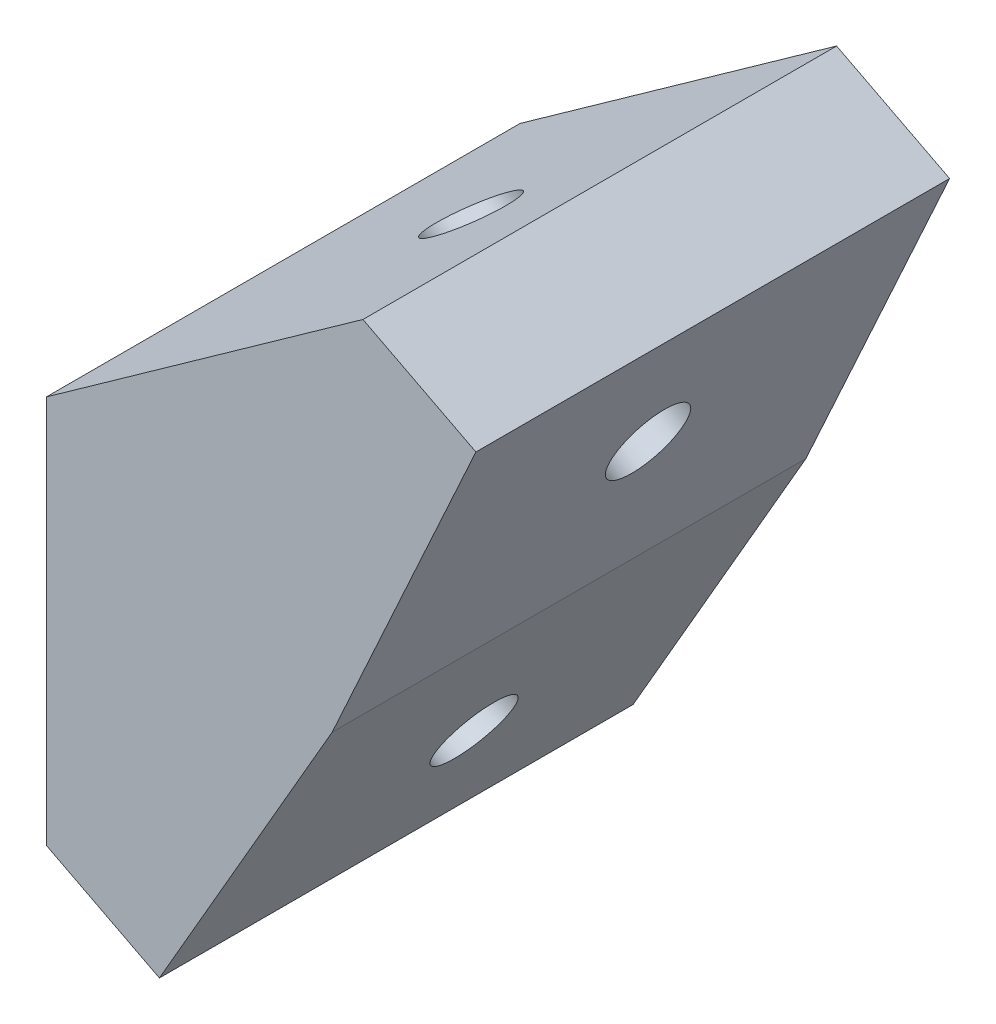
ISO-10303-21;
HEADER;
FILE_DESCRIPTION(('STEP AP214'),'2;1');
FILE_NAME('part.step','',(''),(''),'','','');
FILE_SCHEMA(('AUTOMOTIVE_DESIGN { 1 0 10303 214 1 1 1 1 }'));
ENDSEC;
DATA;
#1=APPLICATION_CONTEXT('core data for automotive mechanical design processes');
#2=APPLICATION_PROTOCOL_DEFINITION('international standard','automotive_design',2000,#1);
#3=PRODUCT_CONTEXT('',#1,'mechanical');
#4=PRODUCT('Part','Part','',(#3));
#5=PRODUCT_RELATED_PRODUCT_CATEGORY('part','',(#4));
#6=PRODUCT_DEFINITION_FORMATION('','',#4);
#7=PRODUCT_DEFINITION_CONTEXT('part definition',#1,'design');
#8=PRODUCT_DEFINITION('design','',#6,#7);
#9=PRODUCT_DEFINITION_SHAPE('','',#8);
#10=(LENGTH_UNIT() NAMED_UNIT(*) SI_UNIT(.MILLI.,.METRE.));
#11=(NAMED_UNIT(*) PLANE_ANGLE_UNIT() SI_UNIT($,.RADIAN.));
#12=(NAMED_UNIT(*) SI_UNIT($,.STERADIAN.) SOLID_ANGLE_UNIT());
#13=UNCERTAINTY_MEASURE_WITH_UNIT(LENGTH_MEASURE(1.E-05),#10,'distance_accuracy_value','');
#14=(GEOMETRIC_REPRESENTATION_CONTEXT(3) GLOBAL_UNCERTAINTY_ASSIGNED_CONTEXT((#13)) GLOBAL_UNIT_ASSIGNED_CONTEXT((#10,
#11,#12)) REPRESENTATION_CONTEXT('',''));
#15=CARTESIAN_POINT('',(0.,0.,0.));
#16=DIRECTION('',(0.,0.,1.));
#17=DIRECTION('',(1.,0.,0.));
#18=AXIS2_PLACEMENT_3D('',#15,#16,#17);
#19=CARTESIAN_POINT('',(5.52101325506801,15.6773344329994,7.5));
#20=DIRECTION('',(-0.866025403784439,0.5,0.));
#21=DIRECTION('',(-0.5,-0.866025403784439,0.));
#22=AXIS2_PLACEMENT_3D('',#19,#20,#21);
#23=PLANE('',#22);
#24=DIRECTION('',(0.5,0.866025403784439,0.));
#25=VECTOR('',#24,1.);
#26=CARTESIAN_POINT('',(5.52101325506801,15.6773344329994,-7.5));
#27=LINE('',#26,#25);
#28=CARTESIAN_POINT('',(0.0473877982673191,6.19673704021823,-7.5));
#29=VERTEX_POINT('',#28);
#30=CARTESIAN_POINT('',(5.52101325506801,15.6773344329994,-7.5));
#31=VERTEX_POINT('',#30);
#32=EDGE_CURVE('E143',#29,#31,#27,.T.);
#33=ORIENTED_EDGE('',*,*,#32,.T.);
#34=DIRECTION('',(0.,0.,-1.));
#35=VECTOR('',#34,1.);
#36=CARTESIAN_POINT('',(5.52101325506801,15.6773344329994,7.5));
#37=LINE('',#36,#35);
#38=CARTESIAN_POINT('',(5.52101325506801,15.6773344329994,7.5));
#39=VERTEX_POINT('',#38);
#40=EDGE_CURVE('E140',#39,#31,#37,.T.);
#41=ORIENTED_EDGE('',*,*,#40,.F.);
#42=DIRECTION('',(0.5,0.866025403784439,0.));
#43=VECTOR('',#42,1.);
#44=CARTESIAN_POINT('',(5.52101325506801,15.6773344329994,7.5));
#45=LINE('',#44,#43);
#46=CARTESIAN_POINT('',(0.0473877982673191,6.19673704021823,7.5));
#47=VERTEX_POINT('',#46);
#48=EDGE_CURVE('E85',#47,#39,#45,.T.);
#49=ORIENTED_EDGE('',*,*,#48,.F.);
#50=DIRECTION('',(0.,0.,-1.));
#51=VECTOR('',#50,1.);
#52=CARTESIAN_POINT('',(0.0473877982673191,6.19673704021823,7.5));
#53=LINE('',#52,#51);
#54=EDGE_CURVE('E52',#47,#29,#53,.T.);
#55=ORIENTED_EDGE('',*,*,#54,.T.);
#56=EDGE_LOOP('',(#33,#41,#49,#55));
#57=FACE_BOUND('',#56,.T.);
#58=CARTESIAN_POINT('',(3.1381275611136,11.5500553424414,0.));
#59=CARTESIAN_POINT('',(3.13812586989761,11.5500524131693,0.0692360372808874));
#60=CARTESIAN_POINT('',(3.13524078057893,11.545055291885,0.138544759383838));
#61=CARTESIAN_POINT('',(3.12377598581995,11.5251976848641,0.275212471246378));
#62=CARTESIAN_POINT('',(3.11519628037548,11.5103371991203,0.342571461004542));
#63=CARTESIAN_POINT('',(3.09258087567953,11.4711661691532,0.473531004420601));
#64=CARTESIAN_POINT('',(3.07854517748246,11.4468556267562,0.537131558804842));
#65=CARTESIAN_POINT('',(3.0454043837457,11.389454088201,0.658806862274307));
#66=CARTESIAN_POINT('',(3.02629928983129,11.3563630948578,0.716881613131123));
#67=CARTESIAN_POINT('',(2.98354679549131,11.2823136025107,0.825907059313257));
#68=CARTESIAN_POINT('',(2.95989939674911,11.2413551064224,0.87685775727871));
#69=CARTESIAN_POINT('',(2.90871448555333,11.1527002396504,0.970228867189444));
#70=CARTESIAN_POINT('',(2.88117697457791,11.1050038715269,1.01264928237607));
#71=CARTESIAN_POINT('',(2.82297137312598,11.0041888125271,1.08779007522114));
#72=CARTESIAN_POINT('',(2.79230328373808,10.9510701235362,1.12051045625263));
#73=CARTESIAN_POINT('',(2.72868239030743,10.8408755036914,1.17534864926352));
#74=CARTESIAN_POINT('',(2.69572958689845,10.7837995739352,1.19746646418398));
#75=CARTESIAN_POINT('',(2.62844814721414,10.6672647019956,1.23048951180264));
#76=CARTESIAN_POINT('',(2.59411951118186,10.6078057602331,1.24139474648159));
#77=CARTESIAN_POINT('',(2.5250332328754,10.4881448161005,1.25169185277393));
#78=CARTESIAN_POINT('',(2.49027559062548,10.4279428137723,1.25108372503852));
#79=CARTESIAN_POINT('',(2.42128996105827,10.3084561983698,1.23837088247362));
#80=CARTESIAN_POINT('',(2.3870619737408,10.2491715852951,1.22626616764806));
#81=CARTESIAN_POINT('',(2.32007970820101,10.1331548981741,1.19089401654128));
#82=CARTESIAN_POINT('',(2.28732542997694,10.0764228241248,1.16762658027333));
#83=CARTESIAN_POINT('',(2.22419398920809,9.96707596115812,1.1105707362929));
#84=CARTESIAN_POINT('',(2.19381682665879,9.91446117223296,1.07678232860045));
#85=CARTESIAN_POINT('',(2.13627745880945,9.81480006368251,0.999616474341237));
#86=CARTESIAN_POINT('',(2.10911525350165,9.76775374404379,0.956239027797604));
#87=CARTESIAN_POINT('',(2.05875496791351,9.68052717072145,0.861091506092004));
#88=CARTESIAN_POINT('',(2.03555688762264,9.64034691701961,0.809321430952323));
#89=CARTESIAN_POINT('',(1.99376468327898,9.56796069573607,0.698816540403905));
#90=CARTESIAN_POINT('',(1.97517055921417,9.53575472813358,0.64008172501333));
#91=CARTESIAN_POINT('',(1.94309911504749,9.48020535736477,0.517267336754076));
#92=CARTESIAN_POINT('',(1.92962179493398,9.45686195417829,0.453187763897552));
#93=CARTESIAN_POINT('',(1.90815567846027,9.41968154980464,0.321451256574637));
#94=CARTESIAN_POINT('',(1.90016688209078,9.40584454860139,0.253794322114296));
#95=CARTESIAN_POINT('',(1.88989815296928,9.38805858803381,0.116769153873438));
#96=CARTESIAN_POINT('',(1.887618220212,9.38410962866033,0.0474009200945013));
#97=CARTESIAN_POINT('',(1.888830101354,9.38620866837099,-0.0911335856280738));
#98=CARTESIAN_POINT('',(1.89232191525297,9.39225666745458,-0.160299857571723));
#99=CARTESIAN_POINT('',(1.90498098163687,9.41418281360788,-0.296522748723887));
#100=CARTESIAN_POINT('',(1.91414823412646,9.43006096068567,-0.363579367930669));
#101=CARTESIAN_POINT('',(1.93790533464748,9.47120946582861,-0.493733448479068));
#102=CARTESIAN_POINT('',(1.95249518268762,9.49647982390884,-0.556830909814327));
#103=CARTESIAN_POINT('',(1.98669506962969,9.55571576570561,-0.677326366223102));
#104=CARTESIAN_POINT('',(2.00630510854273,9.5896813494414,-0.734724361283995));
#105=CARTESIAN_POINT('',(2.05000450921768,9.66537093167074,-0.84223777313558));
#106=CARTESIAN_POINT('',(2.07409387099115,9.70709493018431,-0.892353189907472));
#107=CARTESIAN_POINT('',(2.12608750333505,9.79715054307402,-0.983919194089478));
#108=CARTESIAN_POINT('',(2.15399177391566,9.84548215746776,-1.0253697814765));
#109=CARTESIAN_POINT('',(2.21284558876399,9.94741995500433,-1.09846286172477));
#110=CARTESIAN_POINT('',(2.24379513303921,10.0010261381601,-1.13010535456193));
#111=CARTESIAN_POINT('',(2.30788586644619,10.1120345447154,-1.18270950027546));
#112=CARTESIAN_POINT('',(2.34102705558231,10.1694367681223,-1.2036711531307));
#113=CARTESIAN_POINT('',(2.40858700044712,10.2864540251847,-1.23433546566816));
#114=CARTESIAN_POINT('',(2.44300575617747,10.346069058843,-1.24403812533593));
#115=CARTESIAN_POINT('',(2.51217151827494,10.4658676729401,-1.25191683784364));
#116=CARTESIAN_POINT('',(2.54691852464222,10.5260512533791,-1.25009289067841));
#117=CARTESIAN_POINT('',(2.61578241845685,10.6453270162731,-1.23496869615716));
#118=CARTESIAN_POINT('',(2.64989930590448,10.7044191987285,-1.22166844880613));
#119=CARTESIAN_POINT('',(2.71656197153926,10.8198823225759,-1.18395849642821));
#120=CARTESIAN_POINT('',(2.74910774972842,10.8762532639714,-1.15954879141546));
#121=CARTESIAN_POINT('',(2.81173054295965,10.9847191235597,-1.10029317158901));
#122=CARTESIAN_POINT('',(2.84180755800659,11.036814041761,-1.06544725679587));
#123=CARTESIAN_POINT('',(2.89866325491007,11.1352909974976,-0.98628034509017));
#124=CARTESIAN_POINT('',(2.9254419367747,11.1816730350469,-0.941959348200837));
#125=CARTESIAN_POINT('',(2.97496240402471,11.2674450003385,-0.845064603531355));
#126=CARTESIAN_POINT('',(2.99770418942084,11.3068349280994,-0.792490855773191));
#127=CARTESIAN_POINT('',(3.03852351960834,11.377536081915,-0.680541049183894));
#128=CARTESIAN_POINT('',(3.05660106441177,11.4088473079907,-0.621164990370349));
#129=CARTESIAN_POINT('',(3.08759368006193,11.4625280929562,-0.497246792454289));
#130=CARTESIAN_POINT('',(3.10050875092015,11.484897651866,-0.432704653363263));
#131=CARTESIAN_POINT('',(3.1196515611486,11.5180539717814,-0.307852941350833));
#132=CARTESIAN_POINT('',(3.12647733962545,11.5298765669045,-0.247909616095667));
#133=CARTESIAN_POINT('',(3.13341182724442,11.541887451785,-0.156424213290086));
#134=CARTESIAN_POINT('',(3.13517302677744,11.5449379388584,-0.125353522952144));
#135=CARTESIAN_POINT('',(3.13753460203935,11.549028307198,-0.0628608789359385));
#136=CARTESIAN_POINT('',(3.13812832904222,11.5500566725328,-0.0314379324947314));
#137=CARTESIAN_POINT('',(3.1381275611136,11.5500553424414,0.));
#138=B_SPLINE_CURVE_WITH_KNOTS('',3,(#58,#59,#60,#61,#62,#63,#64,#65,#66,#67,#68,#69,#70,#71,
#72,#73,#74,#75,#76,#77,#78,#79,#80,#81,#82,#83,#84,#85,#86,#87,#88,#89,#90,#91,#92,#93,#94,#95,
#96,#97,#98,#99,#100,#101,#102,#103,#104,#105,#106,#107,#108,#109,#110,#111,#112,#113,#114,#115,
#116,#117,#118,#119,#120,#121,#122,#123,#124,#125,#126,#127,#128,#129,#130,#131,#132,#133,#134,
#135,#136,#137),.UNSPECIFIED.,.T.,.F.,(4,2,2,2,2,2,2,2,2,2,2,2,2,2,2,2,2,2,2,2,2,2,2,2,2,2,2,2,
2,2,2,2,2,2,2,2,2,2,2,4),(0.,0.207595574075841,0.415191148303471,0.622786682411626,
0.830382149963756,1.03797754058198,1.24557285231764,1.45316809186485,1.66076327382698,
1.8683584191167,2.07595355266463,2.28354868614154,2.49114381937172,2.69873895220651,
2.90633408454056,3.11392921632339,3.32152434756491,3.52911947833434,3.73671460875263,
3.9443097389792,4.15190486919446,4.35949999958008,4.56709513029906,4.77469026147786,
4.98228539319258,5.18988052546059,5.39747565823865,5.60507079142764,5.81266592488338,
6.02026105843251,6.22785619189142,6.43545132508637,6.64304645787256,6.85064159014997,
7.05823672187432,7.26583185306194,7.47342698378794,7.65715996579779,7.75089039943371,
7.84515309701598),.UNSPECIFIED.);
#139=CARTESIAN_POINT('',(3.1381275611136,11.5500553424414,0.));
#140=VERTEX_POINT('',#139);
#141=EDGE_CURVE('E158',#140,#140,#138,.T.);
#142=ORIENTED_EDGE('',*,*,#141,.F.);
#143=EDGE_LOOP('',(#142));
#144=FACE_BOUND('',#143,.T.);
#145=ADVANCED_FACE('F38',(#57,#144),#23,.F.);
#146=CARTESIAN_POINT('',(-3.5303,8.04169602348681,7.5));
#147=DIRECTION('',(1.,0.,0.));
#148=DIRECTION('',(0.,1.,0.));
#149=AXIS2_PLACEMENT_3D('',#146,#147,#148);
#150=PLANE('',#149);
#151=DIRECTION('',(0.,-1.,0.));
#152=VECTOR('',#151,1.);
#153=CARTESIAN_POINT('',(-3.5303,8.04169602348681,-7.5));
#154=LINE('',#153,#152);
#155=CARTESIAN_POINT('',(-3.53030000000001,20.3447220636834,-7.5));
#156=VERTEX_POINT('',#155);
#157=CARTESIAN_POINT('',(-3.5303,8.04169602348681,-7.5));
#158=VERTEX_POINT('',#157);
#159=EDGE_CURVE('E75',#156,#158,#154,.T.);
#160=ORIENTED_EDGE('',*,*,#159,.T.);
#161=DIRECTION('',(0.,0.,-1.));
#162=VECTOR('',#161,1.);
#163=CARTESIAN_POINT('',(-3.5303,8.04169602348681,7.5));
#164=LINE('',#163,#162);
#165=CARTESIAN_POINT('',(-3.5303,8.04169602348681,7.5));
#166=VERTEX_POINT('',#165);
#167=EDGE_CURVE('E11',#166,#158,#164,.T.);
#168=ORIENTED_EDGE('',*,*,#167,.F.);
#169=DIRECTION('',(0.,-1.,0.));
#170=VECTOR('',#169,1.);
#171=CARTESIAN_POINT('',(-3.5303,8.04169602348681,7.5));
#172=LINE('',#171,#170);
#173=CARTESIAN_POINT('',(-3.53030000000001,20.3447220636834,7.5));
#174=VERTEX_POINT('',#173);
#175=EDGE_CURVE('E145',#174,#166,#172,.T.);
#176=ORIENTED_EDGE('',*,*,#175,.F.);
#177=DIRECTION('',(0.,0.,-1.));
#178=VECTOR('',#177,1.);
#179=CARTESIAN_POINT('',(-3.53030000000001,20.3447220636834,7.5));
#180=LINE('',#179,#178);
#181=EDGE_CURVE('E123',#174,#156,#180,.T.);
#182=ORIENTED_EDGE('',*,*,#181,.T.);
#183=EDGE_LOOP('',(#160,#168,#176,#182));
#184=FACE_BOUND('',#183,.T.);
#185=CARTESIAN_POINT('',(-3.5303,14.3960916722366,0.));
#186=CARTESIAN_POINT('',(-3.5303,14.3960942115528,-0.0326197951711222));
#187=CARTESIAN_POINT('',(-3.5303,14.3947162205455,-0.0652248467351226));
#188=CARTESIAN_POINT('',(-3.53030000000004,14.3865097332657,-0.162058538444181));
#189=CARTESIAN_POINT('',(-3.53030000000012,14.3756661789056,-0.2259997372909));
#190=CARTESIAN_POINT('',(-3.5302999999999,14.3433964256162,-0.352027765052232));
#191=CARTESIAN_POINT('',(-3.5302999999996,14.3218281013047,-0.41407747562364));
#192=CARTESIAN_POINT('',(-3.53030000000041,14.2688458734506,-0.533848543786156));
#193=CARTESIAN_POINT('',(-3.53030000000153,14.237431499814,-0.591569694549524));
#194=CARTESIAN_POINT('',(-3.53030000000087,14.1835111385334,-0.674260969297359));
#195=CARTESIAN_POINT('',(-3.53030000000024,14.1642171732556,-0.701382589636422));
#196=CARTESIAN_POINT('',(-3.53029999999976,14.1235467885001,-0.754005070432231));
#197=CARTESIAN_POINT('',(-3.5302999999999,14.1021709777443,-0.779506401072007));
#198=CARTESIAN_POINT('',(-3.53030000000014,14.0346527489614,-0.853942994372752));
#199=CARTESIAN_POINT('',(-3.53030000000004,13.9855146681283,-0.900208503678913));
#200=CARTESIAN_POINT('',(-3.53029999999997,13.880768608927,-0.984757380490972));
#201=CARTESIAN_POINT('',(-3.53030000000001,13.825156051861,-1.02303504497877));
#202=CARTESIAN_POINT('',(-3.53030000000001,13.7354033233599,-1.07552757719031));
#203=CARTESIAN_POINT('',(-3.53030000000001,13.7029964016938,-1.09277028002149));
#204=CARTESIAN_POINT('',(-3.5303,13.6369549374573,-1.12462776713492));
#205=CARTESIAN_POINT('',(-3.5303,13.6033215668373,-1.13924498497159));
#206=CARTESIAN_POINT('',(-3.5303,13.5008584103668,-1.17909685755503));
#207=CARTESIAN_POINT('',(-3.5303,13.430434628319,-1.20034970351962));
#208=CARTESIAN_POINT('',(-3.5303,13.2872236252285,-1.23188905925855));
#209=CARTESIAN_POINT('',(-3.53029999999999,13.2144366496285,-1.24217670415428));
#210=CARTESIAN_POINT('',(-3.5303,13.0681402511691,-1.25168770432414));
#211=CARTESIAN_POINT('',(-3.53030000000001,12.994630856402,-1.250911488143));
#212=CARTESIAN_POINT('',(-3.53030000000001,12.8485636372412,-1.23829949671312));
#213=CARTESIAN_POINT('',(-3.53030000000001,12.7760058378474,-1.22646343149413));
#214=CARTESIAN_POINT('',(-3.53030000000001,12.633523888456,-1.19187059687835));
#215=CARTESIAN_POINT('',(-3.53030000000001,12.5635999789551,-1.16911283283128));
#216=CARTESIAN_POINT('',(-3.53030000000001,12.428126316157,-1.11297111348737));
#217=CARTESIAN_POINT('',(-3.5303,12.362577242673,-1.07958551134185));
#218=CARTESIAN_POINT('',(-3.53029999999997,12.2376618638044,-1.00269551653488));
#219=CARTESIAN_POINT('',(-3.53029999999995,12.1782968910058,-0.959188949452417));
#220=CARTESIAN_POINT('',(-3.53029999999994,12.0691028987316,-0.864150894334449));
#221=CARTESIAN_POINT('',(-3.53029999999994,12.0190625380943,-0.812863148982527));
#222=CARTESIAN_POINT('',(-3.53029999999994,11.9299619061856,-0.70456352562487));
#223=CARTESIAN_POINT('',(-3.53029999999993,11.8905718257422,-0.647823392491819));
#224=CARTESIAN_POINT('',(-3.53029999999993,11.8229400351137,-0.530309070940094));
#225=CARTESIAN_POINT('',(-3.53029999999994,11.7943929043923,-0.469712455148631));
#226=CARTESIAN_POINT('',(-3.53029999999998,11.7597783942924,-0.37665980491842));
#227=CARTESIAN_POINT('',(-3.5303,11.7496796935161,-0.345654932259188));
#228=CARTESIAN_POINT('',(-3.5303,11.7320785329445,-0.282883860507105));
#229=CARTESIAN_POINT('',(-3.53029999999999,11.7245785926684,-0.251116954335025));
#230=CARTESIAN_POINT('',(-3.53029999999997,11.7061097584357,-0.154977345592443));
#231=CARTESIAN_POINT('',(-3.5303,11.6991781306764,-0.0897825992668572));
#232=CARTESIAN_POINT('',(-3.53030000000001,11.6964179779469,0.0408286664412094));
#233=CARTESIAN_POINT('',(-3.5303,11.7005869625307,0.106245132791674));
#234=CARTESIAN_POINT('',(-3.5303,11.7149283766317,0.202607632172324));
#235=CARTESIAN_POINT('',(-3.5303,11.7209849581262,0.23421347964676));
#236=CARTESIAN_POINT('',(-3.5303,11.7356741188083,0.296816332316258));
#237=CARTESIAN_POINT('',(-3.53029999999999,11.7443063376725,0.327813422028499));
#238=CARTESIAN_POINT('',(-3.53030000000005,11.7742146986378,0.420374510947481));
#239=CARTESIAN_POINT('',(-3.53030000000019,11.799384536605,0.480722209451567));
#240=CARTESIAN_POINT('',(-3.53029999999981,11.8591051906282,0.596588851527778));
#241=CARTESIAN_POINT('',(-3.53029999999928,11.8936601331831,0.652105656812809));
#242=CARTESIAN_POINT('',(-3.53029999999959,11.952215672922,0.731610227286966));
#243=CARTESIAN_POINT('',(-3.53029999999989,11.9732266019,0.75784973155375));
#244=CARTESIAN_POINT('',(-3.53030000000012,12.0172488105998,0.808577603695189));
#245=CARTESIAN_POINT('',(-3.53030000000005,12.0402594263807,0.83306654791059));
#246=CARTESIAN_POINT('',(-3.53029999999994,12.1125810479994,0.90426218554708));
#247=CARTESIAN_POINT('',(-3.53029999999999,12.1647506938567,0.948115722165898));
#248=CARTESIAN_POINT('',(-3.53030000000001,12.2751440239571,1.02743380437185));
#249=CARTESIAN_POINT('',(-3.53029999999998,12.3333719866253,1.06289236268522));
#250=CARTESIAN_POINT('',(-3.53029999999999,12.4269073593831,1.11081496435879));
#251=CARTESIAN_POINT('',(-3.5303,12.4606430594326,1.12641732626974));
#252=CARTESIAN_POINT('',(-3.53030000000001,12.5292097227054,1.15488942430518));
#253=CARTESIAN_POINT('',(-3.5303,12.5640396418026,1.16776167976245));
#254=CARTESIAN_POINT('',(-3.5303,12.669889136017,1.20223087432397));
#255=CARTESIAN_POINT('',(-3.53030000000001,12.7423000372901,1.2196963092882));
#256=CARTESIAN_POINT('',(-3.53030000000001,12.8888955398854,1.24332303649819));
#257=CARTESIAN_POINT('',(-3.53029999999999,12.9630799942962,1.24948526177642));
#258=CARTESIAN_POINT('',(-3.53029999999998,13.1115303981637,1.25045263655066));
#259=CARTESIAN_POINT('',(-3.53029999999999,13.185796346441,1.24525794831648));
#260=CARTESIAN_POINT('',(-3.53030000000001,13.3326676636162,1.22356743920151));
#261=CARTESIAN_POINT('',(-3.53030000000001,13.405272942598,1.20707100788207));
#262=CARTESIAN_POINT('',(-3.53030000000001,13.5470567273891,1.16298200880802));
#263=CARTESIAN_POINT('',(-3.53030000000001,13.6162348139104,1.13538808711613));
#264=CARTESIAN_POINT('',(-3.53030000000001,13.7493281315409,1.0694927293072));
#265=CARTESIAN_POINT('',(-3.53030000000001,13.8132423700602,1.03118927968018));
#266=CARTESIAN_POINT('',(-3.53030000000004,13.932813902257,0.9453019797986));
#267=CARTESIAN_POINT('',(-3.53030000000007,13.9885973119875,0.897894378210413));
#268=CARTESIAN_POINT('',(-3.53030000000009,14.0894691314094,0.796271234998541));
#269=CARTESIAN_POINT('',(-3.53030000000008,14.1348789521079,0.742375743096158));
#270=CARTESIAN_POINT('',(-3.53030000000005,14.2146064478626,0.629640863912485));
#271=CARTESIAN_POINT('',(-3.53030000000004,14.2492481661191,0.571031231821144));
#272=CARTESIAN_POINT('',(-3.53030000000004,14.3073818316805,0.450483635084469));
#273=CARTESIAN_POINT('',(-3.53030000000005,14.331155020757,0.388682105552033));
#274=CARTESIAN_POINT('',(-3.53030000000003,14.3649517582996,0.27255314073533));
#275=CARTESIAN_POINT('',(-3.53030000000001,14.376605222727,0.218693753724141));
#276=CARTESIAN_POINT('',(-3.53029999999999,14.3921702854893,0.109875107547922));
#277=CARTESIAN_POINT('',(-3.5303,14.3960873972017,0.0549166598733592));
#278=CARTESIAN_POINT('',(-3.5303,14.3960916722366,0.));
#279=B_SPLINE_CURVE_WITH_KNOTS('',3,(#185,#186,#187,#188,#189,#190,#191,#192,#193,#194,#195,
#196,#197,#198,#199,#200,#201,#202,#203,#204,#205,#206,#207,#208,#209,#210,#211,#212,#213,#214,
#215,#216,#217,#218,#219,#220,#221,#222,#223,#224,#225,#226,#227,#228,#229,#230,#231,#232,#233,
#234,#235,#236,#237,#238,#239,#240,#241,#242,#243,#244,#245,#246,#247,#248,#249,#250,#251,#252,
#253,#254,#255,#256,#257,#258,#259,#260,#261,#262,#263,#264,#265,#266,#267,#268,#269,#270,#271,
#272,#273,#274,#275,#276,#277,#278),.UNSPECIFIED.,.T.,.F.,(4,2,2,2,2,2,2,2,2,2,2,2,2,2,2,2,2,2,
2,2,2,2,2,2,2,2,2,2,2,2,2,2,2,2,2,2,2,2,2,2,2,2,2,2,2,2,4),(0.,0.09781856536924,
0.291392142481428,0.487602215990523,0.683821658865948,0.783584483686757,0.883318225399564,
1.08492246533855,1.28667015428753,1.39669196638651,1.5066112673275,1.72634367673541,
1.94605333715904,2.16575448742888,2.38546139804734,2.60518832139716,2.82494930936831,
3.04475755517995,3.25872961251101,3.46501669872184,3.66496390990004,3.76269107227096,
3.86051271853821,4.05620926468592,4.25186190959613,4.34830971136603,4.44474402672182,
4.63996811580247,4.83527818152616,4.93603029663328,5.03674908664934,5.24033509379402,
5.44406586341139,5.55546687694606,5.66676463837761,5.88925501479197,6.11172702473373,
6.33419585597264,6.55667670432079,6.77918470444176,7.00173456669654,7.2203456000429,
7.43079914879559,7.63411294065449,7.83181754383388,7.99661628886084,8.16129754622314),.UNSPECIFIED.);
#280=CARTESIAN_POINT('',(-3.5303,14.3960916722366,0.));
#281=VERTEX_POINT('',#280);
#282=EDGE_CURVE('E42',#281,#281,#279,.T.);
#283=ORIENTED_EDGE('',*,*,#282,.F.);
#284=EDGE_LOOP('',(#283));
#285=FACE_BOUND('',#284,.T.);
#286=ADVANCED_FACE('F184',(#184,#285),#150,.F.);
#287=CARTESIAN_POINT('',(5.52101325506801,15.6773344329994,7.5));
#288=DIRECTION('',(-0.909551391358163,0.415591465839265,0.));
#289=DIRECTION('',(0.415591465839265,0.909551391358163,0.));
#290=AXIS2_PLACEMENT_3D('',#287,#288,#289);
#291=PLANE('',#290);
#292=DIRECTION('',(-0.415591465839265,-0.909551391358163,0.));
#293=VECTOR('',#292,1.);
#294=CARTESIAN_POINT('',(5.52101325506801,15.6773344329994,-7.5));
#295=LINE('',#294,#293);
#296=CARTESIAN_POINT('',(10.0705973091619,25.6344217330125,-7.5));
#297=VERTEX_POINT('',#296);
#298=EDGE_CURVE('E131',#297,#31,#295,.T.);
#299=ORIENTED_EDGE('',*,*,#298,.F.);
#300=DIRECTION('',(0.,0.,-1.));
#301=VECTOR('',#300,1.);
#302=CARTESIAN_POINT('',(10.0705973091619,25.6344217330125,7.5));
#303=LINE('',#302,#301);
#304=CARTESIAN_POINT('',(10.0705973091619,25.6344217330125,7.5));
#305=VERTEX_POINT('',#304);
#306=EDGE_CURVE('E114',#305,#297,#303,.T.);
#307=ORIENTED_EDGE('',*,*,#306,.F.);
#308=DIRECTION('',(-0.415591465839265,-0.909551391358163,0.));
#309=VECTOR('',#308,1.);
#310=CARTESIAN_POINT('',(5.52101325506801,15.6773344329994,7.5));
#311=LINE('',#310,#309);
#312=EDGE_CURVE('E110',#305,#39,#311,.T.);
#313=ORIENTED_EDGE('',*,*,#312,.T.);
#314=ORIENTED_EDGE('',*,*,#40,.T.);
#315=EDGE_LOOP('',(#299,#307,#313,#314));
#316=FACE_BOUND('',#315,.T.);
#317=CARTESIAN_POINT('',(8.54083190025061,22.2864216644429,0.));
#318=CARTESIAN_POINT('',(8.54083049453075,22.2864185879253,0.0692360020484754));
#319=CARTESIAN_POINT('',(8.53843245832623,22.281170315654,0.138544689893136));
#320=CARTESIAN_POINT('',(8.52890312002778,22.2603146830905,0.275212333058135));
#321=CARTESIAN_POINT('',(8.52177181793337,22.2447073227972,0.342571288378272));
#322=CARTESIAN_POINT('',(8.50297428579087,22.2035675908256,0.473530775549629));
#323=CARTESIAN_POINT('',(8.49130805586686,22.1780352194189,0.537131307503673));
#324=CARTESIAN_POINT('',(8.46376199770853,22.1177487179294,0.65880658492784));
#325=CARTESIAN_POINT('',(8.44788216966544,22.0829945882651,0.716881330648758));
#326=CARTESIAN_POINT('',(8.41234702121662,22.005223396192,0.825906785033023));
#327=CARTESIAN_POINT('',(8.39269170100896,21.9622063342165,0.87685749407012));
#328=CARTESIAN_POINT('',(8.35014765739262,21.8690956780891,0.970228640222243));
#329=CARTESIAN_POINT('',(8.32725893415786,21.8190020843178,1.01264907779613));
#330=CARTESIAN_POINT('',(8.27887939528981,21.7131200330542,1.08778992225707));
#331=CARTESIAN_POINT('',(8.25338857978461,21.6573315758423,1.12051032962163));
#332=CARTESIAN_POINT('',(8.20050792541585,21.5415985141445,1.17534857374965));
#333=CARTESIAN_POINT('',(8.17311808662685,21.4816539098219,1.19746641092945));
#334=CARTESIAN_POINT('',(8.11719483501572,21.3592619083176,1.23048949402811));
#335=CARTESIAN_POINT('',(8.08866142222217,21.2968145111985,1.24139474022738));
#336=CARTESIAN_POINT('',(8.03123801229413,21.1711393068458,1.25169185572693));
#337=CARTESIAN_POINT('',(8.00234801516249,21.1079114996185,1.2510837251194));
#338=CARTESIAN_POINT('',(7.94500826174111,20.9824193834624,1.23837086161709));
#339=CARTESIAN_POINT('',(7.91655850545134,20.9201550745337,1.22626612872286));
#340=CARTESIAN_POINT('',(7.86088391659567,20.7983072891016,1.19089392548456));
#341=CARTESIAN_POINT('',(7.83365908402956,20.7387238125979,1.16762645514236));
#342=CARTESIAN_POINT('',(7.78118524037605,20.6238810849962,1.11057052587768));
#343=CARTESIAN_POINT('',(7.7559362292881,20.5686218338972,1.07678206695805));
#344=CARTESIAN_POINT('',(7.70811043039246,20.4639516818273,0.99961609244272));
#345=CARTESIAN_POINT('',(7.68553364258386,20.4145407808544,0.956238576850301));
#346=CARTESIAN_POINT('',(7.64367498839553,20.3229301480892,0.861090899981626));
#347=CARTESIAN_POINT('',(7.62439312201458,20.280730416294,0.809320738708524));
#348=CARTESIAN_POINT('',(7.58965613034962,20.2047060469373,0.69881566174627));
#349=CARTESIAN_POINT('',(7.57420100506421,20.1708814093727,0.640080746059688));
#350=CARTESIAN_POINT('',(7.54754376852763,20.1125401570262,0.517266148564566));
#351=CARTESIAN_POINT('',(7.53634165727509,20.0880235422412,0.453186466757746));
#352=CARTESIAN_POINT('',(7.51849941789337,20.0489745362136,0.321449740857252));
#353=CARTESIAN_POINT('',(7.51185928976308,20.0344421449685,0.253792696764433));
#354=CARTESIAN_POINT('',(7.50332416014382,20.0157624085958,0.116767318344526));
#355=CARTESIAN_POINT('',(7.50142915865422,20.0116150634668,0.0473989840176613));
#356=CARTESIAN_POINT('',(7.50243654896015,20.0138198085824,-0.0911357032637702));
#357=CARTESIAN_POINT('',(7.50533894075564,20.0201718988269,-0.160302056218339));
#358=CARTESIAN_POINT('',(7.51586106582998,20.0432003156451,-0.296525080051325));
#359=CARTESIAN_POINT('',(7.52348079910938,20.0598766422199,-0.363581750929498));
#360=CARTESIAN_POINT('',(7.5432274448214,20.1030935765372,-0.493735897616172));
#361=CARTESIAN_POINT('',(7.55535435725504,20.129634184282,-0.556833373423774));
#362=CARTESIAN_POINT('',(7.58378088493051,20.1918476557412,-0.677328816639076));
#363=CARTESIAN_POINT('',(7.60008050017365,20.2275205194586,-0.73472678404499));
#364=CARTESIAN_POINT('',(7.63640286835362,20.3070145977328,-0.842240096936268));
#365=CARTESIAN_POINT('',(7.65642562129181,20.3508358122926,-0.892355442418971));
#366=CARTESIAN_POINT('',(7.69964201052588,20.4454179444785,-0.983921262195937));
#367=CARTESIAN_POINT('',(7.72283564682296,20.4961788621072,-1.02537173648693));
#368=CARTESIAN_POINT('',(7.77175409108851,20.6032403460454,-1.09846455326542));
#369=CARTESIAN_POINT('',(7.79747889905786,20.6595409123568,-1.13010689574951));
#370=CARTESIAN_POINT('',(7.85075016171663,20.7761288479941,-1.18271070978752));
#371=CARTESIAN_POINT('',(7.87829661640655,20.8364162173212,-1.20367218133844));
#372=CARTESIAN_POINT('',(7.93445140396858,20.9593149516716,-1.23433610728952));
#373=CARTESIAN_POINT('',(7.96305973684087,21.0219263166953,-1.24403856168762));
#374=CARTESIAN_POINT('',(8.02054922407541,21.1477461359186,-1.25191684642697));
#375=CARTESIAN_POINT('',(8.04943037843767,21.2109545901181,-1.25009267676748));
#376=CARTESIAN_POINT('',(8.10666892729524,21.3362252129101,-1.23496802596797));
#377=CARTESIAN_POINT('',(8.13502632179059,21.3982873815027,-1.22166754482866));
#378=CARTESIAN_POINT('',(8.19043521507021,21.5195536733268,-1.18395711862435));
#379=CARTESIAN_POINT('',(8.21748671385473,21.578757796559,-1.15954717356135));
#380=CARTESIAN_POINT('',(8.26953770032323,21.6926750712278,-1.10029107187551));
#381=CARTESIAN_POINT('',(8.2945371880078,21.7473882226656,-1.06544491525557));
#382=CARTESIAN_POINT('',(8.34179462681947,21.850814478391,-0.986277522811376));
#383=CARTESIAN_POINT('',(8.36405257794753,21.8995275826806,-0.9419562869904));
#384=CARTESIAN_POINT('',(8.40521306132911,21.98961021913,-0.84506107282882));
#385=CARTESIAN_POINT('',(8.4241155935839,22.0309797512927,-0.792487094491329));
#386=CARTESIAN_POINT('',(8.45804380047459,22.1052340378224,-0.680536842650365));
#387=CARTESIAN_POINT('',(8.4730694751119,22.1381187921925,-0.621160569149382));
#388=CARTESIAN_POINT('',(8.49882984331193,22.1944971845902,-0.497241965104265));
#389=CARTESIAN_POINT('',(8.50956453687601,22.2179908226207,-0.432699634561757));
#390=CARTESIAN_POINT('',(8.52547540311836,22.2528128815848,-0.307848511635025));
#391=CARTESIAN_POINT('',(8.53114871388675,22.2652293244793,-0.247906003851232));
#392=CARTESIAN_POINT('',(8.536912376877,22.2778435096179,-0.156421892502857));
#393=CARTESIAN_POINT('',(8.5383762134113,22.2810472196695,-0.125351656955196));
#394=CARTESIAN_POINT('',(8.54033905723515,22.2853430425575,-0.0628599380053046));
#395=CARTESIAN_POINT('',(8.54083253853507,22.2864230613737,-0.0314374619131397));
#396=CARTESIAN_POINT('',(8.54083190025061,22.2864216644429,0.));
#397=B_SPLINE_CURVE_WITH_KNOTS('',3,(#317,#318,#319,#320,#321,#322,#323,#324,#325,#326,#327,
#328,#329,#330,#331,#332,#333,#334,#335,#336,#337,#338,#339,#340,#341,#342,#343,#344,#345,#346,
#347,#348,#349,#350,#351,#352,#353,#354,#355,#356,#357,#358,#359,#360,#361,#362,#363,#364,#365,
#366,#367,#368,#369,#370,#371,#372,#373,#374,#375,#376,#377,#378,#379,#380,#381,#382,#383,#384,
#385,#386,#387,#388,#389,#390,#391,#392,#393,#394,#395,#396),.UNSPECIFIED.,.T.,.F.,(4,2,2,2,2,2,
2,2,2,2,2,2,2,2,2,2,2,2,2,2,2,2,2,2,2,2,2,2,2,2,2,2,2,2,2,2,2,2,2,4),(0.,0.20759547011839,
0.415190940258268,0.622786404718689,0.830381859757119,1.0379773039044,1.24557273688468,
1.4531681596456,1.66076357425448,1.86835898367183,2.07595439142694,2.283549799172,
2.49114520688214,2.6987406145363,2.90633602211958,3.11393142962482,3.32152683705343,
3.5291222444152,3.73671765172727,3.9443130590122,4.15190846629552,4.35950387360297,
4.5670992809576,4.77469468837733,4.98229009587293,5.18988550344686,5.39748091109299,
5.60507631879728,5.81267172653935,6.02026713429465,6.22786254203716,6.43545794974231,
6.64305335738959,6.85064876496484,7.0582441724618,7.26583957988278,7.4734349872384,
7.65716535355948,7.75089440007403,7.8451556874404),.UNSPECIFIED.);
#398=CARTESIAN_POINT('',(8.54083190025061,22.2864216644429,0.));
#399=VERTEX_POINT('',#398);
#400=EDGE_CURVE('E135',#399,#399,#397,.T.);
#401=ORIENTED_EDGE('',*,*,#400,.F.);
#402=EDGE_LOOP('',(#401));
#403=FACE_BOUND('',#402,.T.);
#404=ADVANCED_FACE('F180',(#316,#403),#291,.F.);
#405=CARTESIAN_POINT('',(6.49283337114617,27.4792330609398,7.5));
#406=DIRECTION('',(0.579898878044018,-0.814688462691898,0.));
#407=DIRECTION('',(-0.814688462691898,-0.579898878044018,0.));
#408=AXIS2_PLACEMENT_3D('',#405,#406,#407);
#409=PLANE('',#408);
#410=DIRECTION('',(0.814688462691898,0.579898878044018,0.));
#411=VECTOR('',#410,1.);
#412=CARTESIAN_POINT('',(6.49283337114617,27.4792330609398,-7.5));
#413=LINE('',#412,#411);
#414=CARTESIAN_POINT('',(6.49283337114617,27.4792330609398,-7.5));
#415=VERTEX_POINT('',#414);
#416=EDGE_CURVE('E134',#156,#415,#413,.T.);
#417=ORIENTED_EDGE('',*,*,#416,.F.);
#418=ORIENTED_EDGE('',*,*,#181,.F.);
#419=DIRECTION('',(0.814688462691898,0.579898878044018,0.));
#420=VECTOR('',#419,1.);
#421=CARTESIAN_POINT('',(6.49283337114617,27.4792330609398,7.5));
#422=LINE('',#421,#420);
#423=CARTESIAN_POINT('',(6.49283337114617,27.4792330609398,7.5));
#424=VERTEX_POINT('',#423);
#425=EDGE_CURVE('E107',#174,#424,#422,.T.);
#426=ORIENTED_EDGE('',*,*,#425,.T.);
#427=DIRECTION('',(0.,0.,-1.));
#428=VECTOR('',#427,1.);
#429=CARTESIAN_POINT('',(6.49283337114617,27.4792330609398,7.5));
#430=LINE('',#429,#428);
#431=EDGE_CURVE('E117',#424,#415,#430,.T.);
#432=ORIENTED_EDGE('',*,*,#431,.T.);
#433=EDGE_LOOP('',(#417,#418,#426,#432));
#434=FACE_BOUND('',#433,.T.);
#435=CARTESIAN_POINT('',(3.51488874188159,25.359518803932,0.));
#436=CARTESIAN_POINT('',(3.51489089067785,25.3595203334548,-0.0326199461623914));
#437=CARTESIAN_POINT('',(3.51376820792122,25.3587212028659,-0.0652246699183277));
#438=CARTESIAN_POINT('',(3.50708241671948,25.3539622268962,-0.162057565292813));
#439=CARTESIAN_POINT('',(3.49824837710058,25.3476741181303,-0.225998554486133));
#440=CARTESIAN_POINT('',(3.47195896266675,25.3289611957894,-0.352024931138817));
#441=CARTESIAN_POINT('',(3.45438794376691,25.3164540662394,-0.414073243934402));
#442=CARTESIAN_POINT('',(3.41122443840339,25.2857300907815,-0.533843757236736));
#443=CARTESIAN_POINT('',(3.38563130405446,25.267512783706,-0.591565607861311));
#444=CARTESIAN_POINT('',(3.34170274438017,25.2362442391824,-0.67425749056301));
#445=CARTESIAN_POINT('',(3.32598420098938,25.2250557099549,-0.701379094258467));
#446=CARTESIAN_POINT('',(3.29285064681072,25.201471098446,-0.7540014186099));
#447=CARTESIAN_POINT('',(3.27543614028688,25.1890753751021,-0.779502617360095));
#448=CARTESIAN_POINT('',(3.22043013971378,25.1499218587838,-0.853938942837313));
#449=CARTESIAN_POINT('',(3.18039813099594,25.1214268965937,-0.900204340046508));
#450=CARTESIAN_POINT('',(3.09506317920012,25.0606850976479,-0.984753133277041));
#451=CARTESIAN_POINT('',(3.0497565018835,25.0284356028446,-1.02303082014764));
#452=CARTESIAN_POINT('',(2.97663618970417,24.976388238807,-1.07552361250282));
#453=CARTESIAN_POINT('',(2.95023459570985,24.9575954665547,-1.09276649097447));
#454=CARTESIAN_POINT('',(2.89643127141334,24.9192980205697,-1.1246243342767));
#455=CARTESIAN_POINT('',(2.86903049588115,24.8997940264464,-1.13924173262762));
#456=CARTESIAN_POINT('',(2.78555476500298,24.8403756292345,-1.17909415794412));
#457=CARTESIAN_POINT('',(2.72818118877995,24.7995368620189,-1.20034738794466));
#458=CARTESIAN_POINT('',(2.61150853384824,24.7164887463383,-1.23188755981443));
#459=CARTESIAN_POINT('',(2.55220965511909,24.6742795402196,-1.24217563689353));
#460=CARTESIAN_POINT('',(2.43302327706221,24.5894421452172,-1.25168755627469));
#461=CARTESIAN_POINT('',(2.37313580062574,24.5468139726276,-1.25091182717311));
#462=CARTESIAN_POINT('',(2.2541360114569,24.4621093924271,-1.23830085849189));
#463=CARTESIAN_POINT('',(2.19502371908859,24.4200329993115,-1.22646532895947));
#464=CARTESIAN_POINT('',(2.07894465108304,24.3374074014499,-1.19187359398334));
#465=CARTESIAN_POINT('',(2.02197807137236,24.2968583361654,-1.16911639386852));
#466=CARTESIAN_POINT('',(1.91160838811632,24.2182967038099,-1.11297579634147));
#467=CARTESIAN_POINT('',(1.85820583841473,24.1802845309674,-1.07959075201106));
#468=CARTESIAN_POINT('',(1.75643767055543,24.1078454956002,-1.00270182092625));
#469=CARTESIAN_POINT('',(1.70807313807882,24.0734194058682,-0.959195759620166));
#470=CARTESIAN_POINT('',(1.61911279727607,24.0100970388723,-0.86415855436751));
#471=CARTESIAN_POINT('',(1.57834481990566,23.9810782109155,-0.812871147270753));
#472=CARTESIAN_POINT('',(1.50575432847974,23.929407975651,-0.704572202877219));
#473=CARTESIAN_POINT('',(1.47366310134225,23.9065652971742,-0.647832438432797));
#474=CARTESIAN_POINT('',(1.41856315901686,23.8673449126983,-0.530318874032803));
#475=CARTESIAN_POINT('',(1.39530560043887,23.8507900788655,-0.469722666280397));
#476=CARTESIAN_POINT('',(1.36710474836546,23.8307165866949,-0.376670604476997));
#477=CARTESIAN_POINT('',(1.35887719283215,23.8248601760038,-0.345665960757655));
#478=CARTESIAN_POINT('',(1.34453719445099,23.8146529012562,-0.2828953197567));
#479=CARTESIAN_POINT('',(1.33842680421486,23.8103034982579,-0.251128615368547));
#480=CARTESIAN_POINT('',(1.32337963204342,23.7995928540552,-0.154989675378046));
#481=CARTESIAN_POINT('',(1.3177319331669,23.7955727968284,-0.0897953554445795));
#482=CARTESIAN_POINT('',(1.31548206141264,23.7939713280881,0.040815183760015));
#483=CARTESIAN_POINT('',(1.31887785950062,23.796388472299,0.106231349967862));
#484=CARTESIAN_POINT('',(1.33056069283985,23.8047043651293,0.202593484022028));
#485=CARTESIAN_POINT('',(1.33549460114855,23.8082163430492,0.234199217312429));
#486=CARTESIAN_POINT('',(1.3474610479037,23.8167341131727,0.296801873670076));
#487=CARTESIAN_POINT('',(1.35449329279022,23.821739696419,0.32779888125272));
#488=CARTESIAN_POINT('',(1.37885830184809,23.8390828184383,0.420359768445616));
#489=CARTESIAN_POINT('',(1.39936320832293,23.853678302238,0.480707397763049));
#490=CARTESIAN_POINT('',(1.44801558762981,23.888309282627,0.596574040929224));
#491=CARTESIAN_POINT('',(1.47616642243599,23.9083471722844,0.652090916445584));
#492=CARTESIAN_POINT('',(1.52386993546202,23.9423027454256,0.731595737569189));
#493=CARTESIAN_POINT('',(1.54098696781631,23.9544867253296,0.75783536586774));
#494=CARTESIAN_POINT('',(1.5768506991517,23.9800146891047,0.808563522589395));
#495=CARTESIAN_POINT('',(1.59559685719306,23.9933582879327,0.833052627376386));
#496=CARTESIAN_POINT('',(1.6545154653305,24.0352968157498,0.904248800533541));
#497=CARTESIAN_POINT('',(1.69701682220684,24.0655494709629,0.948102773349978));
#498=CARTESIAN_POINT('',(1.78695172055605,24.129565532363,1.02742190863111));
#499=CARTESIAN_POINT('',(1.83438874777697,24.1633314197211,1.06288108370167));
#500=CARTESIAN_POINT('',(1.91059020508325,24.2175719565899,1.11080491138609));
#501=CARTESIAN_POINT('',(1.93807417100865,24.2371351660058,1.12640779477176));
#502=CARTESIAN_POINT('',(1.99393443179242,24.2768967485483,1.1548809569749));
#503=CARTESIAN_POINT('',(2.02230987599011,24.2970945161709,1.16775375509025));
#504=CARTESIAN_POINT('',(2.10854401597609,24.3584763612773,1.20222461155734));
#505=CARTESIAN_POINT('',(2.16753625504421,24.4004672999189,1.21969120057384));
#506=CARTESIAN_POINT('',(2.28696588352705,24.4854778416585,1.2433203300096));
#507=CARTESIAN_POINT('',(2.34740315322621,24.5284973595424,1.2494838035865));
#508=CARTESIAN_POINT('',(2.46834424499107,24.6145837675813,1.25045376271369));
#509=CARTESIAN_POINT('',(2.52884806609294,24.6576506570502,1.24526041062864));
#510=CARTESIAN_POINT('',(2.64850303912683,24.7428216000453,1.22357263908172));
#511=CARTESIAN_POINT('',(2.70765411782225,24.7849256014414,1.20707760924403));
#512=CARTESIAN_POINT('',(2.82316473382347,24.8671465726332,1.16299144072423));
#513=CARTESIAN_POINT('',(2.87952392957026,24.9072632993057,1.1353989481253));
#514=CARTESIAN_POINT('',(2.98795496293701,24.9844449920312,1.06950641002341));
#515=CARTESIAN_POINT('',(3.04002599193422,25.021509382503,1.03120435096755));
#516=CARTESIAN_POINT('',(3.13744176791466,25.0908503659363,0.945319419922239));
#517=CARTESIAN_POINT('',(3.18288921632021,25.1232000622278,0.8979127298999));
#518=CARTESIAN_POINT('',(3.26507092892571,25.181697371467,0.796291162316867));
#519=CARTESIAN_POINT('',(3.30206706166438,25.2080313836073,0.742396375844399));
#520=CARTESIAN_POINT('',(3.36702259546704,25.2542670220138,0.629663077202699));
#521=CARTESIAN_POINT('',(3.39524601340946,25.2743565766704,0.571054341440819));
#522=CARTESIAN_POINT('',(3.44260925864241,25.3080699456807,0.450507415172368));
#523=CARTESIAN_POINT('',(3.46197823314309,25.3218568680396,0.388705710707235));
#524=CARTESIAN_POINT('',(3.48938515059169,25.3413652340063,0.273123824024059));
#525=CARTESIAN_POINT('',(3.49881299726088,25.3480760172765,0.219832995354021));
#526=CARTESIAN_POINT('',(3.51162615281806,25.3571964784983,0.111028862509869));
#527=CARTESIAN_POINT('',(3.51488508639208,25.3595162019383,0.0554924043274301));
#528=CARTESIAN_POINT('',(3.51488874188159,25.359518803932,0.));
#529=B_SPLINE_CURVE_WITH_KNOTS('',3,(#435,#436,#437,#438,#439,#440,#441,#442,#443,#444,#445,
#446,#447,#448,#449,#450,#451,#452,#453,#454,#455,#456,#457,#458,#459,#460,#461,#462,#463,#464,
#465,#466,#467,#468,#469,#470,#471,#472,#473,#474,#475,#476,#477,#478,#479,#480,#481,#482,#483,
#484,#485,#486,#487,#488,#489,#490,#491,#492,#493,#494,#495,#496,#497,#498,#499,#500,#501,#502,
#503,#504,#505,#506,#507,#508,#509,#510,#511,#512,#513,#514,#515,#516,#517,#518,#519,#520,#521,
#522,#523,#524,#525,#526,#527,#528),.UNSPECIFIED.,.T.,.F.,(4,2,2,2,2,2,2,2,2,2,2,2,2,2,2,2,2,2,
2,2,2,2,2,2,2,2,2,2,2,2,2,2,2,2,2,2,2,2,2,2,2,2,2,2,2,2,4),(0.,0.0978181491148919,
0.291390651959259,0.487596384547912,0.683817967266109,0.783580695801312,0.883313851729597,
1.08491728904302,1.28666433092876,1.39668654934924,1.50660625747765,1.72633947812682,
1.94604994783401,2.16575190628816,2.38545962479026,2.60518735656778,2.82494915451049,
3.04475821306657,3.25873126935309,3.46501867037407,3.66496562359259,3.76269243039064,
3.86051372086233,4.05620922696456,4.25186082975814,4.34830807464791,4.44474183276767,
4.63996478615077,4.83527371994459,4.93602536907205,5.03674369121516,5.24032871716005,
5.44405851086915,5.55545978147322,5.66675780034424,5.8892486888182,6.11172120816032,
6.33419054690963,6.55667190162795,6.77918040783797,7.00173077701829,7.22034384747731,
7.43079865158691,7.63411297630937,7.83181745796298,7.99491722438654,8.16132351623692),.UNSPECIFIED.);
#530=CARTESIAN_POINT('',(3.51488874188159,25.359518803932,0.));
#531=VERTEX_POINT('',#530);
#532=EDGE_CURVE('E151',#531,#531,#529,.T.);
#533=ORIENTED_EDGE('',*,*,#532,.F.);
#534=EDGE_LOOP('',(#533));
#535=FACE_BOUND('',#534,.T.);
#536=ADVANCED_FACE('F125',(#434,#535),#409,.F.);
#537=CARTESIAN_POINT('',(0.0473877982673191,6.19673704021823,7.5));
#538=DIRECTION('',(0.458331073152111,0.88878154086549,0.));
#539=DIRECTION('',(-0.88878154086549,0.458331073152111,0.));
#540=AXIS2_PLACEMENT_3D('',#537,#538,#539);
#541=PLANE('',#540);
#542=DIRECTION('',(0.88878154086549,-0.458331073152111,0.));
#543=VECTOR('',#542,1.);
#544=CARTESIAN_POINT('',(0.0473877982673191,6.19673704021823,-7.5));
#545=LINE('',#544,#543);
#546=EDGE_CURVE('E80',#158,#29,#545,.T.);
#547=ORIENTED_EDGE('',*,*,#546,.T.);
#548=ORIENTED_EDGE('',*,*,#54,.F.);
#549=DIRECTION('',(0.88878154086549,-0.458331073152111,0.));
#550=VECTOR('',#549,1.);
#551=CARTESIAN_POINT('',(0.0473877982673191,6.19673704021823,7.5));
#552=LINE('',#551,#550);
#553=EDGE_CURVE('E61',#166,#47,#552,.T.);
#554=ORIENTED_EDGE('',*,*,#553,.F.);
#555=ORIENTED_EDGE('',*,*,#167,.T.);
#556=EDGE_LOOP('',(#547,#548,#554,#555));
#557=FACE_BOUND('',#556,.T.);
#558=ADVANCED_FACE('F189',(#557),#541,.F.);
#559=CARTESIAN_POINT('',(0.,0.,7.5));
#560=DIRECTION('',(0.,0.,-1.));
#561=DIRECTION('',(-1.,0.,0.));
#562=AXIS2_PLACEMENT_3D('',#559,#560,#561);
#563=PLANE('',#562);
#564=ORIENTED_EDGE('',*,*,#48,.T.);
#565=ORIENTED_EDGE('',*,*,#312,.F.);
#566=DIRECTION('',(0.888800455764353,-0.458294392103022,0.));
#567=VECTOR('',#566,1.);
#568=CARTESIAN_POINT('',(10.0705973091619,25.6344217330125,7.5));
#569=LINE('',#568,#567);
#570=EDGE_CURVE('E103',#424,#305,#569,.T.);
#571=ORIENTED_EDGE('',*,*,#570,.F.);
#572=ORIENTED_EDGE('',*,*,#425,.F.);
#573=ORIENTED_EDGE('',*,*,#175,.T.);
#574=ORIENTED_EDGE('',*,*,#553,.T.);
#575=EDGE_LOOP('',(#564,#565,#571,#572,#573,#574));
#576=FACE_BOUND('',#575,.T.);
#577=ADVANCED_FACE('F105',(#576),#563,.F.);
#578=CARTESIAN_POINT('',(0.,0.,-7.5));
#579=DIRECTION('',(0.,0.,-1.));
#580=DIRECTION('',(-1.,0.,0.));
#581=AXIS2_PLACEMENT_3D('',#578,#579,#580);
#582=PLANE('',#581);
#583=ORIENTED_EDGE('',*,*,#32,.F.);
#584=ORIENTED_EDGE('',*,*,#546,.F.);
#585=ORIENTED_EDGE('',*,*,#159,.F.);
#586=ORIENTED_EDGE('',*,*,#416,.T.);
#587=DIRECTION('',(0.888800455764353,-0.458294392103022,0.));
#588=VECTOR('',#587,1.);
#589=CARTESIAN_POINT('',(10.0705973091619,25.6344217330125,-7.5));
#590=LINE('',#589,#588);
#591=EDGE_CURVE('E119',#415,#297,#590,.T.);
#592=ORIENTED_EDGE('',*,*,#591,.T.);
#593=ORIENTED_EDGE('',*,*,#298,.T.);
#594=EDGE_LOOP('',(#583,#584,#585,#586,#592,#593));
#595=FACE_BOUND('',#594,.T.);
#596=ADVANCED_FACE('F188',(#595),#582,.T.);
#597=CARTESIAN_POINT('',(10.0705973091619,25.6344217330125,7.5));
#598=DIRECTION('',(-0.458294392103022,-0.888800455764353,0.));
#599=DIRECTION('',(-0.888800455764353,0.458294392103022,0.));
#600=AXIS2_PLACEMENT_3D('',#597,#598,#599);
#601=PLANE('',#600);
#602=ORIENTED_EDGE('',*,*,#591,.F.);
#603=ORIENTED_EDGE('',*,*,#431,.F.);
#604=ORIENTED_EDGE('',*,*,#570,.T.);
#605=ORIENTED_EDGE('',*,*,#306,.T.);
#606=EDGE_LOOP('',(#602,#603,#604,#605));
#607=FACE_BOUND('',#606,.T.);
#608=ADVANCED_FACE('F118',(#607),#601,.F.);
#609=CARTESIAN_POINT('',(53.8955457765484,-6.90015471059607,0.));
#610=DIRECTION('',(0.909551767444541,-0.415590642746575,0.));
#611=DIRECTION('',(0.415590642746575,0.909551767444541,0.));
#612=AXIS2_PLACEMENT_3D('',#609,#610,#611);
#613=CIRCLE('',#612,1.25);
#614=DIRECTION('',(-0.853154357707885,0.521658549171819,0.));
#615=VECTOR('',#614,1.);
#616=SURFACE_OF_LINEAR_EXTRUSION('',#613,#615);
#617=ORIENTED_EDGE('',*,*,#532,.T.);
#618=EDGE_LOOP('',(#617));
#619=FACE_BOUND('',#618,.T.);
#620=ORIENTED_EDGE('',*,*,#400,.T.);
#621=EDGE_LOOP('',(#620));
#622=FACE_BOUND('',#621,.T.);
#623=ADVANCED_FACE('F162',(#619,#622),#616,.T.);
#624=CARTESIAN_POINT('',(51.9675244845357,-10.6392518965019,0.));
#625=DIRECTION('',(0.866022207890615,-0.500005535409624,0.));
#626=DIRECTION('',(0.500005535409624,0.866022207890615,0.));
#627=AXIS2_PLACEMENT_3D('',#624,#625,#626);
#628=CIRCLE('',#627,1.25);
#629=DIRECTION('',(-0.91973631541177,0.392536762753224,0.));
#630=VECTOR('',#629,1.);
#631=SURFACE_OF_LINEAR_EXTRUSION('',#628,#630);
#632=ORIENTED_EDGE('',*,*,#282,.T.);
#633=EDGE_LOOP('',(#632));
#634=FACE_BOUND('',#633,.T.);
#635=ORIENTED_EDGE('',*,*,#141,.T.);
#636=EDGE_LOOP('',(#635));
#637=FACE_BOUND('',#636,.T.);
#638=ADVANCED_FACE('F166',(#634,#637),#631,.T.);
#639=CLOSED_SHELL('',(#145,#286,#404,#536,#558,#577,#596,#608,#623,#638));
#640=MANIFOLD_SOLID_BREP('B2',#639);
#641=ADVANCED_BREP_SHAPE_REPRESENTATION('',(#18,#640),#14);
#642=SHAPE_DEFINITION_REPRESENTATION(#9,#641);
ENDSEC;
END-ISO-10303-21;
